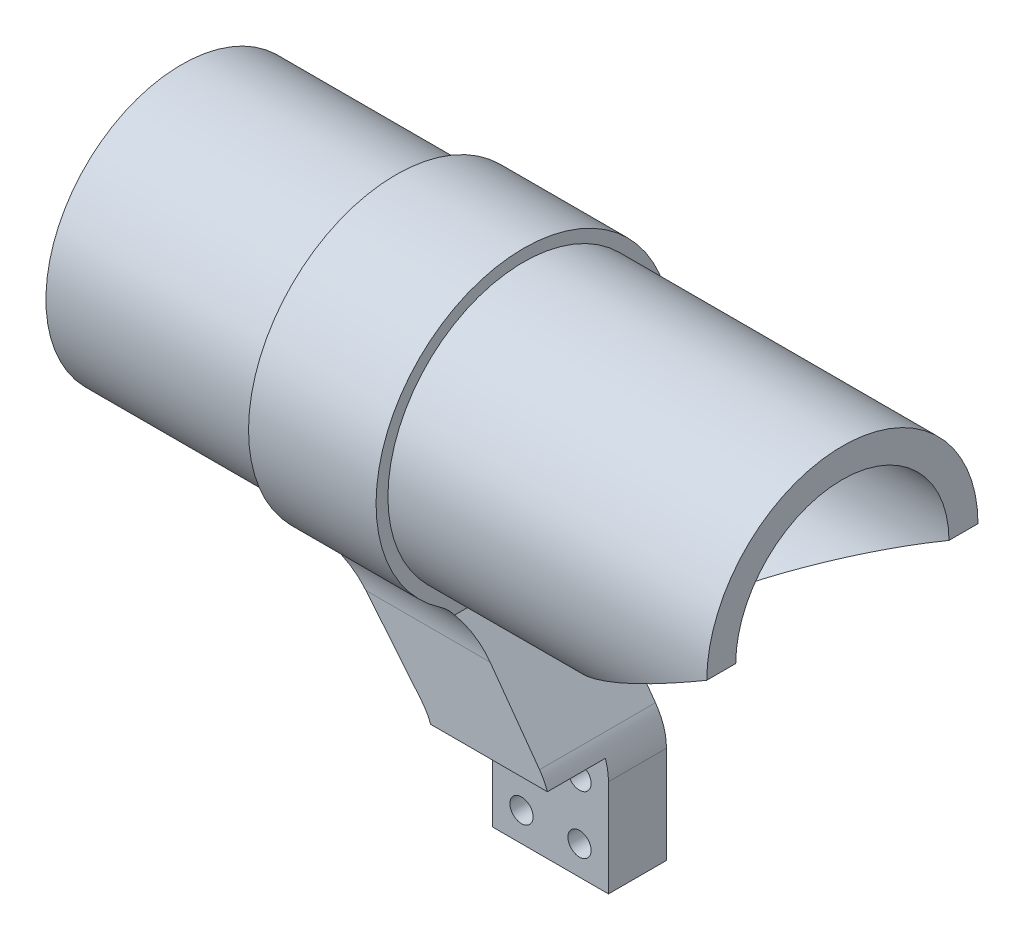
ISO-10303-21;
HEADER;
FILE_DESCRIPTION(('STEP AP214'),'2;1');
FILE_NAME('part.step','',(''),(''),'','','');
FILE_SCHEMA(('AUTOMOTIVE_DESIGN { 1 0 10303 214 1 1 1 1 }'));
ENDSEC;
DATA;
#1=APPLICATION_CONTEXT('core data for automotive mechanical design processes');
#2=APPLICATION_PROTOCOL_DEFINITION('international standard','automotive_design',2000,#1);
#3=PRODUCT_CONTEXT('',#1,'mechanical');
#4=PRODUCT('Part','Part','',(#3));
#5=PRODUCT_RELATED_PRODUCT_CATEGORY('part','',(#4));
#6=PRODUCT_DEFINITION_FORMATION('','',#4);
#7=PRODUCT_DEFINITION_CONTEXT('part definition',#1,'design');
#8=PRODUCT_DEFINITION('design','',#6,#7);
#9=PRODUCT_DEFINITION_SHAPE('','',#8);
#10=(LENGTH_UNIT() NAMED_UNIT(*) SI_UNIT(.MILLI.,.METRE.));
#11=(NAMED_UNIT(*) PLANE_ANGLE_UNIT() SI_UNIT($,.RADIAN.));
#12=(NAMED_UNIT(*) SI_UNIT($,.STERADIAN.) SOLID_ANGLE_UNIT());
#13=UNCERTAINTY_MEASURE_WITH_UNIT(LENGTH_MEASURE(1.E-05),#10,'distance_accuracy_value','');
#14=(GEOMETRIC_REPRESENTATION_CONTEXT(3) GLOBAL_UNCERTAINTY_ASSIGNED_CONTEXT((#13)) GLOBAL_UNIT_ASSIGNED_CONTEXT((#10,
#11,#12)) REPRESENTATION_CONTEXT('',''));
#15=CARTESIAN_POINT('',(0.,0.,0.));
#16=DIRECTION('',(0.,0.,1.));
#17=DIRECTION('',(1.,0.,0.));
#18=AXIS2_PLACEMENT_3D('',#15,#16,#17);
#19=CARTESIAN_POINT('',(114.,0.,0.));
#20=DIRECTION('',(-1.,0.,0.));
#21=DIRECTION('',(0.,0.,1.));
#22=AXIS2_PLACEMENT_3D('',#19,#20,#21);
#23=CYLINDRICAL_SURFACE('',#22,23.4);
#24=CARTESIAN_POINT('',(0.,0.,0.));
#25=DIRECTION('',(1.,0.,0.));
#26=DIRECTION('',(0.,0.,-1.));
#27=AXIS2_PLACEMENT_3D('',#24,#25,#26);
#28=CIRCLE('',#27,23.4);
#29=CARTESIAN_POINT('',(0.,0.,-23.4));
#30=VERTEX_POINT('',#29);
#31=EDGE_CURVE('E266',#30,#30,#28,.T.);
#32=ORIENTED_EDGE('',*,*,#31,.T.);
#33=EDGE_LOOP('',(#32));
#34=FACE_BOUND('',#33,.T.);
#35=CARTESIAN_POINT('',(37.,0.,0.));
#36=DIRECTION('',(1.,0.,0.));
#37=DIRECTION('',(0.,0.,-1.));
#38=AXIS2_PLACEMENT_3D('',#35,#36,#37);
#39=CIRCLE('',#38,23.4);
#40=CARTESIAN_POINT('',(37.,-23.4,0.));
#41=VERTEX_POINT('',#40);
#42=EDGE_CURVE('E276',#41,#41,#39,.T.);
#43=ORIENTED_EDGE('',*,*,#42,.F.);
#44=EDGE_LOOP('',(#43));
#45=FACE_BOUND('',#44,.T.);
#46=ADVANCED_FACE('F39',(#34,#45),#23,.T.);
#47=CARTESIAN_POINT('',(5.,0.,0.));
#48=DIRECTION('',(-1.,0.,0.));
#49=DIRECTION('',(0.,0.,1.));
#50=AXIS2_PLACEMENT_3D('',#47,#48,#49);
#51=CYLINDRICAL_SURFACE('',#50,7.5);
#52=CARTESIAN_POINT('',(0.,0.,0.));
#53=DIRECTION('',(-1.,0.,0.));
#54=DIRECTION('',(0.,0.,1.));
#55=AXIS2_PLACEMENT_3D('',#52,#53,#54);
#56=CIRCLE('',#55,7.5);
#57=CARTESIAN_POINT('',(0.,0.,7.5));
#58=VERTEX_POINT('',#57);
#59=EDGE_CURVE('E257',#58,#58,#56,.T.);
#60=ORIENTED_EDGE('',*,*,#59,.T.);
#61=EDGE_LOOP('',(#60));
#62=FACE_BOUND('',#61,.T.);
#63=CARTESIAN_POINT('',(2.5,0.,0.));
#64=DIRECTION('',(1.,0.,0.));
#65=DIRECTION('',(0.,0.,-1.));
#66=AXIS2_PLACEMENT_3D('',#63,#64,#65);
#67=CIRCLE('',#66,7.5);
#68=CARTESIAN_POINT('',(2.5,0.,-7.5));
#69=VERTEX_POINT('',#68);
#70=EDGE_CURVE('E226',#69,#69,#67,.F.);
#71=ORIENTED_EDGE('',*,*,#70,.F.);
#72=EDGE_LOOP('',(#71));
#73=FACE_BOUND('',#72,.T.);
#74=ADVANCED_FACE('F371',(#62,#73),#51,.F.);
#75=CARTESIAN_POINT('',(0.,0.,0.));
#76=DIRECTION('',(1.,0.,0.));
#77=DIRECTION('',(0.,0.,-1.));
#78=AXIS2_PLACEMENT_3D('',#75,#76,#77);
#79=PLANE('',#78);
#80=ORIENTED_EDGE('',*,*,#31,.F.);
#81=EDGE_LOOP('',(#80));
#82=FACE_BOUND('',#81,.T.);
#83=ORIENTED_EDGE('',*,*,#59,.F.);
#84=EDGE_LOOP('',(#83));
#85=FACE_BOUND('',#84,.T.);
#86=CARTESIAN_POINT('',(0.,-8.48186500766342,-11.1381311714208));
#87=DIRECTION('',(-1.,0.,0.));
#88=DIRECTION('',(0.,0.,1.));
#89=AXIS2_PLACEMENT_3D('',#86,#87,#88);
#90=CIRCLE('',#89,1.24999999999999);
#91=CARTESIAN_POINT('',(0.,-8.48186500766342,-9.88813117142085));
#92=VERTEX_POINT('',#91);
#93=EDGE_CURVE('E251',#92,#92,#90,.T.);
#94=ORIENTED_EDGE('',*,*,#93,.F.);
#95=EDGE_LOOP('',(#94));
#96=FACE_BOUND('',#95,.T.);
#97=CARTESIAN_POINT('',(0.,-11.1381311714208,8.48186500766334));
#98=DIRECTION('',(-1.,0.,0.));
#99=DIRECTION('',(0.,0.,1.));
#100=AXIS2_PLACEMENT_3D('',#97,#98,#99);
#101=CIRCLE('',#100,1.24999999999999);
#102=CARTESIAN_POINT('',(0.,-11.1381311714208,9.73186500766333));
#103=VERTEX_POINT('',#102);
#104=EDGE_CURVE('E245',#103,#103,#101,.T.);
#105=ORIENTED_EDGE('',*,*,#104,.F.);
#106=EDGE_LOOP('',(#105));
#107=FACE_BOUND('',#106,.T.);
#108=CARTESIAN_POINT('',(0.,8.48186500766336,11.1381311714207));
#109=DIRECTION('',(-1.,0.,0.));
#110=DIRECTION('',(0.,0.,1.));
#111=AXIS2_PLACEMENT_3D('',#108,#109,#110);
#112=CIRCLE('',#111,1.24999999999999);
#113=CARTESIAN_POINT('',(0.,8.48186500766336,12.3881311714207));
#114=VERTEX_POINT('',#113);
#115=EDGE_CURVE('E239',#114,#114,#112,.T.);
#116=ORIENTED_EDGE('',*,*,#115,.F.);
#117=EDGE_LOOP('',(#116));
#118=FACE_BOUND('',#117,.T.);
#119=CARTESIAN_POINT('',(0.,11.1381311714207,-8.48186500766345));
#120=DIRECTION('',(-1.,0.,0.));
#121=DIRECTION('',(0.,0.,1.));
#122=AXIS2_PLACEMENT_3D('',#119,#120,#121);
#123=CIRCLE('',#122,1.24999999999999);
#124=CARTESIAN_POINT('',(0.,11.1381311714207,-7.23186500766346));
#125=VERTEX_POINT('',#124);
#126=EDGE_CURVE('E235',#125,#125,#123,.T.);
#127=ORIENTED_EDGE('',*,*,#126,.F.);
#128=EDGE_LOOP('',(#127));
#129=FACE_BOUND('',#128,.T.);
#130=ADVANCED_FACE('F380',(#82,#85,#96,#107,#118,#129),#79,.F.);
#131=CARTESIAN_POINT('',(5.,0.,0.));
#132=DIRECTION('',(-1.,0.,0.));
#133=DIRECTION('',(0.,0.,1.));
#134=AXIS2_PLACEMENT_3D('',#131,#132,#133);
#135=PLANE('',#134);
#136=CARTESIAN_POINT('',(5.,0.,0.));
#137=DIRECTION('',(1.,0.,0.));
#138=DIRECTION('',(0.,0.,-1.));
#139=AXIS2_PLACEMENT_3D('',#136,#137,#138);
#140=CIRCLE('',#139,11.4999999999999);
#141=CARTESIAN_POINT('',(5.,0.,-11.4999999999999));
#142=VERTEX_POINT('',#141);
#143=EDGE_CURVE('E218',#142,#142,#140,.T.);
#144=ORIENTED_EDGE('',*,*,#143,.F.);
#145=EDGE_LOOP('',(#144));
#146=FACE_BOUND('',#145,.T.);
#147=CARTESIAN_POINT('',(5.,-8.48186500766342,-11.1381311714208));
#148=DIRECTION('',(-1.,0.,0.));
#149=DIRECTION('',(0.,0.,1.));
#150=AXIS2_PLACEMENT_3D('',#147,#148,#149);
#151=CIRCLE('',#150,1.24999999999999);
#152=CARTESIAN_POINT('',(5.,-8.48186500766342,-9.88813117142085));
#153=VERTEX_POINT('',#152);
#154=EDGE_CURVE('E254',#153,#153,#151,.T.);
#155=ORIENTED_EDGE('',*,*,#154,.T.);
#156=EDGE_LOOP('',(#155));
#157=FACE_BOUND('',#156,.T.);
#158=CARTESIAN_POINT('',(5.,-11.1381311714208,8.48186500766334));
#159=DIRECTION('',(-1.,0.,0.));
#160=DIRECTION('',(0.,0.,1.));
#161=AXIS2_PLACEMENT_3D('',#158,#159,#160);
#162=CIRCLE('',#161,1.24999999999999);
#163=CARTESIAN_POINT('',(5.,-11.1381311714208,9.73186500766333));
#164=VERTEX_POINT('',#163);
#165=EDGE_CURVE('E248',#164,#164,#162,.T.);
#166=ORIENTED_EDGE('',*,*,#165,.T.);
#167=EDGE_LOOP('',(#166));
#168=FACE_BOUND('',#167,.T.);
#169=CARTESIAN_POINT('',(5.,8.48186500766336,11.1381311714207));
#170=DIRECTION('',(-1.,0.,0.));
#171=DIRECTION('',(0.,0.,1.));
#172=AXIS2_PLACEMENT_3D('',#169,#170,#171);
#173=CIRCLE('',#172,1.24999999999999);
#174=CARTESIAN_POINT('',(5.,8.48186500766336,12.3881311714207));
#175=VERTEX_POINT('',#174);
#176=EDGE_CURVE('E242',#175,#175,#173,.T.);
#177=ORIENTED_EDGE('',*,*,#176,.T.);
#178=EDGE_LOOP('',(#177));
#179=FACE_BOUND('',#178,.T.);
#180=CARTESIAN_POINT('',(5.,11.1381311714207,-8.48186500766345));
#181=DIRECTION('',(-1.,0.,0.));
#182=DIRECTION('',(0.,0.,1.));
#183=AXIS2_PLACEMENT_3D('',#180,#181,#182);
#184=CIRCLE('',#183,1.24999999999999);
#185=CARTESIAN_POINT('',(5.,11.1381311714207,-7.23186500766346));
#186=VERTEX_POINT('',#185);
#187=EDGE_CURVE('E236',#186,#186,#184,.T.);
#188=ORIENTED_EDGE('',*,*,#187,.T.);
#189=EDGE_LOOP('',(#188));
#190=FACE_BOUND('',#189,.T.);
#191=CARTESIAN_POINT('',(5.,0.,0.));
#192=DIRECTION('',(-1.,0.,0.));
#193=DIRECTION('',(0.,0.,1.));
#194=AXIS2_PLACEMENT_3D('',#191,#192,#193);
#195=CIRCLE('',#194,18.4);
#196=CARTESIAN_POINT('',(5.,0.,18.4));
#197=VERTEX_POINT('',#196);
#198=EDGE_CURVE('E262',#197,#197,#195,.T.);
#199=ORIENTED_EDGE('',*,*,#198,.F.);
#200=EDGE_LOOP('',(#199));
#201=FACE_BOUND('',#200,.T.);
#202=ADVANCED_FACE('F409',(#146,#157,#168,#179,#190,#201),#135,.F.);
#203=CARTESIAN_POINT('',(5.,-8.48186500766342,-11.1381311714208));
#204=DIRECTION('',(-1.,0.,0.));
#205=DIRECTION('',(0.,0.,1.));
#206=AXIS2_PLACEMENT_3D('',#203,#204,#205);
#207=CYLINDRICAL_SURFACE('',#206,1.24999999999999);
#208=ORIENTED_EDGE('',*,*,#154,.F.);
#209=EDGE_LOOP('',(#208));
#210=FACE_BOUND('',#209,.T.);
#211=ORIENTED_EDGE('',*,*,#93,.T.);
#212=EDGE_LOOP('',(#211));
#213=FACE_BOUND('',#212,.T.);
#214=ADVANCED_FACE('F411',(#210,#213),#207,.F.);
#215=CARTESIAN_POINT('',(5.,-11.1381311714208,8.48186500766334));
#216=DIRECTION('',(-1.,0.,0.));
#217=DIRECTION('',(0.,0.,1.));
#218=AXIS2_PLACEMENT_3D('',#215,#216,#217);
#219=CYLINDRICAL_SURFACE('',#218,1.24999999999999);
#220=ORIENTED_EDGE('',*,*,#165,.F.);
#221=EDGE_LOOP('',(#220));
#222=FACE_BOUND('',#221,.T.);
#223=ORIENTED_EDGE('',*,*,#104,.T.);
#224=EDGE_LOOP('',(#223));
#225=FACE_BOUND('',#224,.T.);
#226=ADVANCED_FACE('F418',(#222,#225),#219,.F.);
#227=CARTESIAN_POINT('',(5.,8.48186500766336,11.1381311714207));
#228=DIRECTION('',(-1.,0.,0.));
#229=DIRECTION('',(0.,0.,1.));
#230=AXIS2_PLACEMENT_3D('',#227,#228,#229);
#231=CYLINDRICAL_SURFACE('',#230,1.24999999999999);
#232=ORIENTED_EDGE('',*,*,#176,.F.);
#233=EDGE_LOOP('',(#232));
#234=FACE_BOUND('',#233,.T.);
#235=ORIENTED_EDGE('',*,*,#115,.T.);
#236=EDGE_LOOP('',(#235));
#237=FACE_BOUND('',#236,.T.);
#238=ADVANCED_FACE('F446',(#234,#237),#231,.F.);
#239=CARTESIAN_POINT('',(5.,11.1381311714207,-8.48186500766345));
#240=DIRECTION('',(-1.,0.,0.));
#241=DIRECTION('',(0.,0.,1.));
#242=AXIS2_PLACEMENT_3D('',#239,#240,#241);
#243=CYLINDRICAL_SURFACE('',#242,1.24999999999999);
#244=ORIENTED_EDGE('',*,*,#187,.F.);
#245=EDGE_LOOP('',(#244));
#246=FACE_BOUND('',#245,.T.);
#247=ORIENTED_EDGE('',*,*,#126,.T.);
#248=EDGE_LOOP('',(#247));
#249=FACE_BOUND('',#248,.T.);
#250=ADVANCED_FACE('F441',(#246,#249),#243,.F.);
#251=CARTESIAN_POINT('',(2.5,0.,0.));
#252=DIRECTION('',(1.,0.,0.));
#253=DIRECTION('',(0.,0.,-1.));
#254=AXIS2_PLACEMENT_3D('',#251,#252,#253);
#255=PLANE('',#254);
#256=CARTESIAN_POINT('',(2.5,0.,0.));
#257=DIRECTION('',(1.,0.,0.));
#258=DIRECTION('',(0.,0.,-1.));
#259=AXIS2_PLACEMENT_3D('',#256,#257,#258);
#260=CIRCLE('',#259,11.4999999999999);
#261=CARTESIAN_POINT('',(2.5,0.,-11.4999999999999));
#262=VERTEX_POINT('',#261);
#263=EDGE_CURVE('E223',#262,#262,#260,.T.);
#264=ORIENTED_EDGE('',*,*,#263,.T.);
#265=EDGE_LOOP('',(#264));
#266=FACE_BOUND('',#265,.T.);
#267=ORIENTED_EDGE('',*,*,#70,.T.);
#268=EDGE_LOOP('',(#267));
#269=FACE_BOUND('',#268,.T.);
#270=ADVANCED_FACE('F438',(#266,#269),#255,.T.);
#271=CARTESIAN_POINT('',(2.5,0.,0.));
#272=DIRECTION('',(1.,0.,0.));
#273=DIRECTION('',(0.,0.,-1.));
#274=AXIS2_PLACEMENT_3D('',#271,#272,#273);
#275=CYLINDRICAL_SURFACE('',#274,11.4999999999999);
#276=ORIENTED_EDGE('',*,*,#263,.F.);
#277=EDGE_LOOP('',(#276));
#278=FACE_BOUND('',#277,.T.);
#279=ORIENTED_EDGE('',*,*,#143,.T.);
#280=EDGE_LOOP('',(#279));
#281=FACE_BOUND('',#280,.T.);
#282=ADVANCED_FACE('F440',(#278,#281),#275,.F.);
#283=CARTESIAN_POINT('',(37.,0.,0.));
#284=DIRECTION('',(1.,0.,0.));
#285=DIRECTION('',(0.,0.,-1.));
#286=AXIS2_PLACEMENT_3D('',#283,#284,#285);
#287=PLANE('',#286);
#288=DIRECTION('',(0.,0.,-1.));
#289=VECTOR('',#288,1.);
#290=CARTESIAN_POINT('',(37.,-23.4,10.));
#291=LINE('',#290,#289);
#292=CARTESIAN_POINT('',(37.,-23.4,-11.9012968975138));
#293=VERTEX_POINT('',#292);
#294=EDGE_CURVE('E221',#41,#293,#291,.T.);
#295=ORIENTED_EDGE('',*,*,#294,.F.);
#296=ORIENTED_EDGE('',*,*,#42,.T.);
#297=CARTESIAN_POINT('',(37.,-23.4,11.9012968975138));
#298=VERTEX_POINT('',#297);
#299=EDGE_CURVE('E61',#298,#41,#291,.T.);
#300=ORIENTED_EDGE('',*,*,#299,.F.);
#301=CARTESIAN_POINT('',(37.,-29.2660896735201,20.));
#302=DIRECTION('',(1.,0.,0.));
#303=DIRECTION('',(0.,0.,-1.));
#304=AXIS2_PLACEMENT_3D('',#301,#302,#303);
#305=CIRCLE('',#304,10.);
#306=CARTESIAN_POINT('',(37.,-21.009841090767,14.3578054500233));
#307=VERTEX_POINT('',#306);
#308=EDGE_CURVE('E305',#298,#307,#305,.T.);
#309=ORIENTED_EDGE('',*,*,#308,.T.);
#310=CARTESIAN_POINT('',(37.,0.,0.));
#311=DIRECTION('',(1.,0.,0.));
#312=DIRECTION('',(0.,0.,-1.));
#313=AXIS2_PLACEMENT_3D('',#310,#311,#312);
#314=CIRCLE('',#313,25.4472002389261);
#315=CARTESIAN_POINT('',(37.,-21.009841090767,-14.3578054500233));
#316=VERTEX_POINT('',#315);
#317=EDGE_CURVE('E212',#316,#307,#314,.T.);
#318=ORIENTED_EDGE('',*,*,#317,.F.);
#319=CARTESIAN_POINT('',(37.,-29.2660896735201,-20.));
#320=DIRECTION('',(1.,0.,0.));
#321=DIRECTION('',(0.,0.,-1.));
#322=AXIS2_PLACEMENT_3D('',#319,#320,#321);
#323=CIRCLE('',#322,10.);
#324=EDGE_CURVE('E293',#316,#293,#323,.T.);
#325=ORIENTED_EDGE('',*,*,#324,.T.);
#326=EDGE_LOOP('',(#295,#296,#300,#309,#318,#325));
#327=FACE_BOUND('',#326,.T.);
#328=ADVANCED_FACE('F361',(#327),#287,.F.);
#329=CARTESIAN_POINT('',(59.,0.,0.));
#330=DIRECTION('',(1.,0.,0.));
#331=DIRECTION('',(0.,0.,-1.));
#332=AXIS2_PLACEMENT_3D('',#329,#330,#331);
#333=PLANE('',#332);
#334=DIRECTION('',(0.,0.,-1.));
#335=VECTOR('',#334,1.);
#336=CARTESIAN_POINT('',(59.,-23.4,10.));
#337=LINE('',#336,#335);
#338=CARTESIAN_POINT('',(59.,-23.4,11.9012968975138));
#339=VERTEX_POINT('',#338);
#340=CARTESIAN_POINT('',(59.,-23.4,0.));
#341=VERTEX_POINT('',#340);
#342=EDGE_CURVE('E53',#339,#341,#337,.T.);
#343=ORIENTED_EDGE('',*,*,#342,.T.);
#344=CARTESIAN_POINT('',(59.,0.,0.));
#345=DIRECTION('',(1.,0.,0.));
#346=DIRECTION('',(0.,0.,-1.));
#347=AXIS2_PLACEMENT_3D('',#344,#345,#346);
#348=CIRCLE('',#347,23.4);
#349=EDGE_CURVE('E280',#341,#341,#348,.T.);
#350=ORIENTED_EDGE('',*,*,#349,.F.);
#351=CARTESIAN_POINT('',(59.,-23.4,-11.9012968975138));
#352=VERTEX_POINT('',#351);
#353=EDGE_CURVE('E216',#341,#352,#337,.T.);
#354=ORIENTED_EDGE('',*,*,#353,.T.);
#355=CARTESIAN_POINT('',(59.,-29.2660896735201,-20.));
#356=DIRECTION('',(1.,0.,0.));
#357=DIRECTION('',(0.,0.,-1.));
#358=AXIS2_PLACEMENT_3D('',#355,#356,#357);
#359=CIRCLE('',#358,10.);
#360=CARTESIAN_POINT('',(59.,-21.009841090767,-14.3578054500233));
#361=VERTEX_POINT('',#360);
#362=EDGE_CURVE('E301',#352,#361,#359,.F.);
#363=ORIENTED_EDGE('',*,*,#362,.T.);
#364=CARTESIAN_POINT('',(59.,0.,0.));
#365=DIRECTION('',(1.,0.,0.));
#366=DIRECTION('',(0.,0.,-1.));
#367=AXIS2_PLACEMENT_3D('',#364,#365,#366);
#368=CIRCLE('',#367,25.4472002389261);
#369=CARTESIAN_POINT('',(59.,-21.009841090767,14.3578054500233));
#370=VERTEX_POINT('',#369);
#371=EDGE_CURVE('E213',#361,#370,#368,.T.);
#372=ORIENTED_EDGE('',*,*,#371,.T.);
#373=CARTESIAN_POINT('',(59.,-29.2660896735201,20.));
#374=DIRECTION('',(1.,0.,0.));
#375=DIRECTION('',(0.,0.,-1.));
#376=AXIS2_PLACEMENT_3D('',#373,#374,#375);
#377=CIRCLE('',#376,10.);
#378=EDGE_CURVE('E47',#370,#339,#377,.F.);
#379=ORIENTED_EDGE('',*,*,#378,.T.);
#380=EDGE_LOOP('',(#343,#350,#354,#363,#372,#379));
#381=FACE_BOUND('',#380,.T.);
#382=ADVANCED_FACE('F309',(#381),#333,.T.);
#383=CARTESIAN_POINT('',(59.,0.,0.));
#384=DIRECTION('',(-1.,0.,0.));
#385=DIRECTION('',(0.,0.,1.));
#386=AXIS2_PLACEMENT_3D('',#383,#384,#385);
#387=CYLINDRICAL_SURFACE('',#386,25.4472002389261);
#388=ORIENTED_EDGE('',*,*,#371,.F.);
#389=DIRECTION('',(-1.,0.,0.));
#390=VECTOR('',#389,1.);
#391=CARTESIAN_POINT('',(59.,-21.009841090767,-14.3578054500233));
#392=LINE('',#391,#390);
#393=EDGE_CURVE('E285',#361,#316,#392,.T.);
#394=ORIENTED_EDGE('',*,*,#393,.T.);
#395=ORIENTED_EDGE('',*,*,#317,.T.);
#396=DIRECTION('',(-1.,0.,0.));
#397=VECTOR('',#396,1.);
#398=CARTESIAN_POINT('',(59.,-21.009841090767,14.3578054500233));
#399=LINE('',#398,#397);
#400=EDGE_CURVE('E283',#307,#370,#399,.F.);
#401=ORIENTED_EDGE('',*,*,#400,.T.);
#402=EDGE_LOOP('',(#388,#394,#395,#401));
#403=FACE_BOUND('',#402,.T.);
#404=ADVANCED_FACE('F363',(#403),#387,.T.);
#405=CARTESIAN_POINT('',(114.,0.,0.));
#406=DIRECTION('',(1.,0.,0.));
#407=DIRECTION('',(0.,0.,-1.));
#408=AXIS2_PLACEMENT_3D('',#405,#406,#407);
#409=PLANE('',#408);
#410=DIRECTION('',(0.,0.,1.));
#411=VECTOR('',#410,1.);
#412=CARTESIAN_POINT('',(114.,0.0999999999999994,-23.5));
#413=LINE('',#412,#411);
#414=CARTESIAN_POINT('',(114.,0.0999999999999994,-23.3997863238107));
#415=VERTEX_POINT('',#414);
#416=CARTESIAN_POINT('',(114.,0.0999999999999994,-18.399728258863));
#417=VERTEX_POINT('',#416);
#418=EDGE_CURVE('E232',#415,#417,#413,.T.);
#419=ORIENTED_EDGE('',*,*,#418,.F.);
#420=CARTESIAN_POINT('',(114.,0.,0.));
#421=DIRECTION('',(1.,0.,0.));
#422=DIRECTION('',(0.,0.,-1.));
#423=AXIS2_PLACEMENT_3D('',#420,#421,#422);
#424=CIRCLE('',#423,23.4);
#425=CARTESIAN_POINT('',(114.,0.0999999999999994,23.3997863238107));
#426=VERTEX_POINT('',#425);
#427=EDGE_CURVE('E267',#415,#426,#424,.T.);
#428=ORIENTED_EDGE('',*,*,#427,.T.);
#429=CARTESIAN_POINT('',(114.,0.0999999999999994,18.399728258863));
#430=VERTEX_POINT('',#429);
#431=EDGE_CURVE('E229',#430,#426,#413,.T.);
#432=ORIENTED_EDGE('',*,*,#431,.F.);
#433=CARTESIAN_POINT('',(114.,0.,0.));
#434=DIRECTION('',(1.,0.,0.));
#435=DIRECTION('',(0.,0.,-1.));
#436=AXIS2_PLACEMENT_3D('',#433,#434,#435);
#437=CIRCLE('',#436,18.4);
#438=EDGE_CURVE('E263',#417,#430,#437,.T.);
#439=ORIENTED_EDGE('',*,*,#438,.F.);
#440=EDGE_LOOP('',(#419,#428,#432,#439));
#441=FACE_BOUND('',#440,.T.);
#442=ADVANCED_FACE('F402',(#441),#409,.T.);
#443=CARTESIAN_POINT('',(114.,0.,0.));
#444=DIRECTION('',(-1.,0.,0.));
#445=DIRECTION('',(0.,0.,1.));
#446=AXIS2_PLACEMENT_3D('',#443,#444,#445);
#447=CYLINDRICAL_SURFACE('',#446,18.4);
#448=CARTESIAN_POINT('',(113.829787234043,0.,0.));
#449=DIRECTION('',(-0.506549048630866,0.862211146605728,0.));
#450=DIRECTION('',(-0.862211146605728,-0.506549048630866,0.));
#451=AXIS2_PLACEMENT_3D('',#448,#449,#450);
#452=ELLIPSE('',#451,36.3242218097788,18.4);
#453=EDGE_CURVE('E233',#417,#430,#452,.T.);
#454=ORIENTED_EDGE('',*,*,#453,.F.);
#455=ORIENTED_EDGE('',*,*,#438,.T.);
#456=EDGE_LOOP('',(#454,#455));
#457=FACE_BOUND('',#456,.T.);
#458=ORIENTED_EDGE('',*,*,#198,.T.);
#459=EDGE_LOOP('',(#458));
#460=FACE_BOUND('',#459,.T.);
#461=ADVANCED_FACE('F392',(#457,#460),#447,.F.);
#462=CARTESIAN_POINT('',(114.,0.0999999999999994,-23.5));
#463=DIRECTION('',(-0.506549048630866,0.862211146605728,0.));
#464=DIRECTION('',(-0.862211146605728,-0.506549048630866,0.));
#465=AXIS2_PLACEMENT_3D('',#462,#463,#464);
#466=PLANE('',#465);
#467=ORIENTED_EDGE('',*,*,#453,.T.);
#468=ORIENTED_EDGE('',*,*,#431,.T.);
#469=CARTESIAN_POINT('',(113.829787234043,0.,0.));
#470=DIRECTION('',(-0.506549048630866,0.862211146605728,0.));
#471=DIRECTION('',(-0.862211146605728,-0.506549048630866,0.));
#472=AXIS2_PLACEMENT_3D('',#469,#470,#471);
#473=ELLIPSE('',#472,46.1949342580883,23.4);
#474=EDGE_CURVE('E270',#415,#426,#473,.T.);
#475=ORIENTED_EDGE('',*,*,#474,.F.);
#476=ORIENTED_EDGE('',*,*,#418,.T.);
#477=EDGE_LOOP('',(#467,#468,#475,#476));
#478=FACE_BOUND('',#477,.T.);
#479=ADVANCED_FACE('F384',(#478),#466,.F.);
#480=ORIENTED_EDGE('',*,*,#349,.T.);
#481=EDGE_LOOP('',(#480));
#482=FACE_BOUND('',#481,.T.);
#483=ORIENTED_EDGE('',*,*,#474,.T.);
#484=ORIENTED_EDGE('',*,*,#427,.F.);
#485=EDGE_LOOP('',(#483,#484));
#486=FACE_BOUND('',#485,.T.);
#487=ADVANCED_FACE('F374',(#482,#486),#23,.T.);
#488=CARTESIAN_POINT('',(0.,0.,10.));
#489=DIRECTION('',(0.,0.,-1.));
#490=DIRECTION('',(-1.,0.,0.));
#491=AXIS2_PLACEMENT_3D('',#488,#489,#490);
#492=PLANE('',#491);
#493=DIRECTION('',(-0.585327901781094,0.810796674510042,0.));
#494=VECTOR('',#493,1.);
#495=CARTESIAN_POINT('',(73.6501592134182,-43.6934121799724,10.));
#496=LINE('',#495,#494);
#497=CARTESIAN_POINT('',(71.7581259585187,-41.0725662123242,10.));
#498=VERTEX_POINT('',#497);
#499=CARTESIAN_POINT('',(63.2348298509441,-29.2660896735201,10.));
#500=VERTEX_POINT('',#499);
#501=EDGE_CURVE('E318',#498,#500,#496,.T.);
#502=ORIENTED_EDGE('',*,*,#501,.T.);
#503=DIRECTION('',(1.,0.,0.));
#504=VECTOR('',#503,1.);
#505=CARTESIAN_POINT('',(37.,-29.2660896735201,10.));
#506=LINE('',#505,#504);
#507=CARTESIAN_POINT('',(41.8129573360113,-29.2660896735201,10.));
#508=VERTEX_POINT('',#507);
#509=EDGE_CURVE('E290',#500,#508,#506,.F.);
#510=ORIENTED_EDGE('',*,*,#509,.T.);
#511=DIRECTION('',(0.634297358068504,-0.773089167914876,0.));
#512=VECTOR('',#511,1.);
#513=CARTESIAN_POINT('',(37.,-23.4,10.));
#514=LINE('',#513,#512);
#515=CARTESIAN_POINT('',(51.381050892567,-40.9277959569798,10.));
#516=VERTEX_POINT('',#515);
#517=EDGE_CURVE('E188',#508,#516,#514,.T.);
#518=ORIENTED_EDGE('',*,*,#517,.T.);
#519=CARTESIAN_POINT('',(43.6501592134182,-47.2707695376648,10.));
#520=DIRECTION('',(0.,0.,-1.));
#521=DIRECTION('',(-1.,0.,0.));
#522=AXIS2_PLACEMENT_3D('',#519,#520,#521);
#523=CIRCLE('',#522,10.);
#524=CARTESIAN_POINT('',(52.988387864258,-43.6934121799724,10.));
#525=VERTEX_POINT('',#524);
#526=EDGE_CURVE('E205',#516,#525,#523,.T.);
#527=ORIENTED_EDGE('',*,*,#526,.T.);
#528=DIRECTION('',(-1.,0.,0.));
#529=VECTOR('',#528,1.);
#530=CARTESIAN_POINT('',(73.6501592134182,-43.6934121799724,10.));
#531=LINE('',#530,#529);
#532=CARTESIAN_POINT('',(73.113318124491,-43.6934121799724,10.));
#533=VERTEX_POINT('',#532);
#534=EDGE_CURVE('E167',#533,#525,#531,.T.);
#535=ORIENTED_EDGE('',*,*,#534,.F.);
#536=CARTESIAN_POINT('',(63.6501592134183,-46.9258452301351,10.));
#537=DIRECTION('',(0.,0.,-1.));
#538=DIRECTION('',(-1.,0.,0.));
#539=AXIS2_PLACEMENT_3D('',#536,#537,#538);
#540=CIRCLE('',#539,10.);
#541=EDGE_CURVE('E200',#533,#498,#540,.F.);
#542=ORIENTED_EDGE('',*,*,#541,.T.);
#543=EDGE_LOOP('',(#502,#510,#518,#527,#535,#542));
#544=FACE_BOUND('',#543,.T.);
#545=ADVANCED_FACE('F321',(#544),#492,.F.);
#546=CARTESIAN_POINT('',(0.,0.,-10.));
#547=DIRECTION('',(0.,0.,-1.));
#548=DIRECTION('',(-1.,0.,0.));
#549=AXIS2_PLACEMENT_3D('',#546,#547,#548);
#550=PLANE('',#549);
#551=CARTESIAN_POINT('',(68.6501592134182,-58.6934121799724,-10.));
#552=DIRECTION('',(0.,0.,1.));
#553=DIRECTION('',(1.,0.,0.));
#554=AXIS2_PLACEMENT_3D('',#551,#552,#553);
#555=CIRCLE('',#554,2.);
#556=CARTESIAN_POINT('',(70.6501592134182,-58.6934121799724,-10.));
#557=VERTEX_POINT('',#556);
#558=EDGE_CURVE('E740',#557,#557,#555,.T.);
#559=ORIENTED_EDGE('',*,*,#558,.T.);
#560=EDGE_LOOP('',(#559));
#561=FACE_BOUND('',#560,.T.);
#562=CARTESIAN_POINT('',(58.6501592134182,-48.6934121799724,-10.));
#563=DIRECTION('',(0.,0.,1.));
#564=DIRECTION('',(1.,0.,0.));
#565=AXIS2_PLACEMENT_3D('',#562,#563,#564);
#566=CIRCLE('',#565,2.);
#567=CARTESIAN_POINT('',(60.6501592134182,-48.6934121799724,-10.));
#568=VERTEX_POINT('',#567);
#569=EDGE_CURVE('E331',#568,#568,#566,.T.);
#570=ORIENTED_EDGE('',*,*,#569,.T.);
#571=EDGE_LOOP('',(#570));
#572=FACE_BOUND('',#571,.T.);
#573=DIRECTION('',(0.634297358068504,-0.773089167914876,0.));
#574=VECTOR('',#573,1.);
#575=CARTESIAN_POINT('',(37.,-23.4,-10.));
#576=LINE('',#575,#574);
#577=CARTESIAN_POINT('',(41.8129573360113,-29.2660896735201,-10.));
#578=VERTEX_POINT('',#577);
#579=CARTESIAN_POINT('',(51.381050892567,-40.9277959569798,-10.));
#580=VERTEX_POINT('',#579);
#581=EDGE_CURVE('E329',#578,#580,#576,.T.);
#582=ORIENTED_EDGE('',*,*,#581,.F.);
#583=DIRECTION('',(-1.,0.,0.));
#584=VECTOR('',#583,1.);
#585=CARTESIAN_POINT('',(0.,-29.2660896735201,-10.));
#586=LINE('',#585,#584);
#587=CARTESIAN_POINT('',(63.2348298509441,-29.2660896735201,-10.));
#588=VERTEX_POINT('',#587);
#589=EDGE_CURVE('E288',#578,#588,#586,.F.);
#590=ORIENTED_EDGE('',*,*,#589,.T.);
#591=DIRECTION('',(-0.585327901781094,0.810796674510042,0.));
#592=VECTOR('',#591,1.);
#593=CARTESIAN_POINT('',(73.6501592134182,-43.6934121799724,-10.));
#594=LINE('',#593,#592);
#595=CARTESIAN_POINT('',(71.7581259585187,-41.0725662123242,-10.));
#596=VERTEX_POINT('',#595);
#597=EDGE_CURVE('E337',#596,#588,#594,.T.);
#598=ORIENTED_EDGE('',*,*,#597,.F.);
#599=CARTESIAN_POINT('',(63.6501592134183,-46.9258452301351,-10.));
#600=DIRECTION('',(0.,0.,-1.));
#601=DIRECTION('',(-1.,0.,0.));
#602=AXIS2_PLACEMENT_3D('',#599,#600,#601);
#603=CIRCLE('',#602,10.);
#604=CARTESIAN_POINT('',(73.6501592134182,-46.9258452301351,-10.));
#605=VERTEX_POINT('',#604);
#606=EDGE_CURVE('E197',#596,#605,#603,.T.);
#607=ORIENTED_EDGE('',*,*,#606,.T.);
#608=DIRECTION('',(0.,1.,0.));
#609=VECTOR('',#608,1.);
#610=CARTESIAN_POINT('',(73.6501592134182,-43.6934121799724,-10.));
#611=LINE('',#610,#609);
#612=CARTESIAN_POINT('',(73.6501592134182,-63.6934121799724,-10.));
#613=VERTEX_POINT('',#612);
#614=EDGE_CURVE('E335',#613,#605,#611,.T.);
#615=ORIENTED_EDGE('',*,*,#614,.F.);
#616=DIRECTION('',(1.,0.,0.));
#617=VECTOR('',#616,1.);
#618=CARTESIAN_POINT('',(73.6501592134182,-63.6934121799724,-10.));
#619=LINE('',#618,#617);
#620=CARTESIAN_POINT('',(53.6501592134182,-63.6934121799724,-10.));
#621=VERTEX_POINT('',#620);
#622=EDGE_CURVE('E182',#621,#613,#619,.T.);
#623=ORIENTED_EDGE('',*,*,#622,.F.);
#624=DIRECTION('',(0.,-1.,0.));
#625=VECTOR('',#624,1.);
#626=CARTESIAN_POINT('',(53.6501592134182,-63.6934121799724,-10.));
#627=LINE('',#626,#625);
#628=CARTESIAN_POINT('',(53.6501592134182,-47.2707695376648,-10.));
#629=VERTEX_POINT('',#628);
#630=EDGE_CURVE('E325',#629,#621,#627,.T.);
#631=ORIENTED_EDGE('',*,*,#630,.F.);
#632=CARTESIAN_POINT('',(43.6501592134182,-47.2707695376648,-10.));
#633=DIRECTION('',(0.,0.,-1.));
#634=DIRECTION('',(-1.,0.,0.));
#635=AXIS2_PLACEMENT_3D('',#632,#633,#634);
#636=CIRCLE('',#635,10.);
#637=EDGE_CURVE('E202',#629,#580,#636,.F.);
#638=ORIENTED_EDGE('',*,*,#637,.T.);
#639=EDGE_LOOP('',(#582,#590,#598,#607,#615,#623,#631,#638));
#640=FACE_BOUND('',#639,.T.);
#641=CARTESIAN_POINT('',(58.6501592134182,-58.6934121799724,-10.));
#642=DIRECTION('',(0.,0.,1.));
#643=DIRECTION('',(1.,0.,0.));
#644=AXIS2_PLACEMENT_3D('',#641,#642,#643);
#645=CIRCLE('',#644,2.);
#646=CARTESIAN_POINT('',(60.6501592134182,-58.6934121799724,-10.));
#647=VERTEX_POINT('',#646);
#648=EDGE_CURVE('E742',#647,#647,#645,.T.);
#649=ORIENTED_EDGE('',*,*,#648,.T.);
#650=EDGE_LOOP('',(#649));
#651=FACE_BOUND('',#650,.T.);
#652=CARTESIAN_POINT('',(68.6501592134182,-48.6934121799724,-10.));
#653=DIRECTION('',(0.,0.,1.));
#654=DIRECTION('',(1.,0.,0.));
#655=AXIS2_PLACEMENT_3D('',#652,#653,#654);
#656=CIRCLE('',#655,2.);
#657=CARTESIAN_POINT('',(70.6501592134182,-48.6934121799724,-10.));
#658=VERTEX_POINT('',#657);
#659=EDGE_CURVE('E737',#658,#658,#656,.T.);
#660=ORIENTED_EDGE('',*,*,#659,.T.);
#661=EDGE_LOOP('',(#660));
#662=FACE_BOUND('',#661,.T.);
#663=ADVANCED_FACE('F350',(#561,#572,#640,#651,#662),#550,.T.);
#664=CARTESIAN_POINT('',(73.6501592134182,-63.6934121799724,10.));
#665=DIRECTION('',(0.,1.,0.));
#666=DIRECTION('',(0.,0.,1.));
#667=AXIS2_PLACEMENT_3D('',#664,#665,#666);
#668=PLANE('',#667);
#669=DIRECTION('',(0.,0.,-1.));
#670=VECTOR('',#669,1.);
#671=CARTESIAN_POINT('',(73.6501592134182,-63.6934121799724,10.));
#672=LINE('',#671,#670);
#673=CARTESIAN_POINT('',(73.6501592134182,-63.6934121799724,0.));
#674=VERTEX_POINT('',#673);
#675=EDGE_CURVE('E173',#674,#613,#672,.T.);
#676=ORIENTED_EDGE('',*,*,#675,.F.);
#677=DIRECTION('',(1.,0.,0.));
#678=VECTOR('',#677,1.);
#679=CARTESIAN_POINT('',(50.4957971199191,-63.6934121799724,0.));
#680=LINE('',#679,#678);
#681=CARTESIAN_POINT('',(53.6501592134182,-63.6934121799724,0.));
#682=VERTEX_POINT('',#681);
#683=EDGE_CURVE('E157',#682,#674,#680,.T.);
#684=ORIENTED_EDGE('',*,*,#683,.F.);
#685=DIRECTION('',(0.,0.,-1.));
#686=VECTOR('',#685,1.);
#687=CARTESIAN_POINT('',(53.6501592134182,-63.6934121799724,10.));
#688=LINE('',#687,#686);
#689=EDGE_CURVE('E184',#682,#621,#688,.T.);
#690=ORIENTED_EDGE('',*,*,#689,.T.);
#691=ORIENTED_EDGE('',*,*,#622,.T.);
#692=EDGE_LOOP('',(#676,#684,#690,#691));
#693=FACE_BOUND('',#692,.T.);
#694=ADVANCED_FACE('F180',(#693),#668,.F.);
#695=CARTESIAN_POINT('',(73.6501592134182,-43.6934121799724,10.));
#696=DIRECTION('',(-1.,0.,0.));
#697=DIRECTION('',(0.,0.,1.));
#698=AXIS2_PLACEMENT_3D('',#695,#696,#697);
#699=PLANE('',#698);
#700=DIRECTION('',(0.,0.,-1.));
#701=VECTOR('',#700,1.);
#702=CARTESIAN_POINT('',(73.6501592134182,-46.9258452301351,10.));
#703=LINE('',#702,#701);
#704=CARTESIAN_POINT('',(73.6501592134182,-46.9258452301351,0.));
#705=VERTEX_POINT('',#704);
#706=EDGE_CURVE('E176',#605,#705,#703,.F.);
#707=ORIENTED_EDGE('',*,*,#706,.T.);
#708=DIRECTION('',(0.,1.,0.));
#709=VECTOR('',#708,1.);
#710=CARTESIAN_POINT('',(73.6501592134182,-43.6934121799724,0.));
#711=LINE('',#710,#709);
#712=EDGE_CURVE('E160',#674,#705,#711,.T.);
#713=ORIENTED_EDGE('',*,*,#712,.F.);
#714=ORIENTED_EDGE('',*,*,#675,.T.);
#715=ORIENTED_EDGE('',*,*,#614,.T.);
#716=EDGE_LOOP('',(#707,#713,#714,#715));
#717=FACE_BOUND('',#716,.T.);
#718=ADVANCED_FACE('F171',(#717),#699,.F.);
#719=CARTESIAN_POINT('',(73.6501592134182,-43.6934121799724,10.));
#720=DIRECTION('',(-0.810796674510042,-0.585327901781094,0.));
#721=DIRECTION('',(0.585327901781094,-0.810796674510042,0.));
#722=AXIS2_PLACEMENT_3D('',#719,#720,#721);
#723=PLANE('',#722);
#724=ORIENTED_EDGE('',*,*,#501,.F.);
#725=DIRECTION('',(0.,0.,-1.));
#726=VECTOR('',#725,1.);
#727=CARTESIAN_POINT('',(71.7581259585187,-41.0725662123242,10.));
#728=LINE('',#727,#726);
#729=EDGE_CURVE('E194',#498,#596,#728,.T.);
#730=ORIENTED_EDGE('',*,*,#729,.T.);
#731=ORIENTED_EDGE('',*,*,#597,.T.);
#732=CARTESIAN_POINT('',(63.2348298509441,-29.2660896735201,-20.));
#733=DIRECTION('',(-0.810796674510042,-0.585327901781094,0.));
#734=DIRECTION('',(-0.585327901781094,0.810796674510042,0.));
#735=AXIS2_PLACEMENT_3D('',#732,#733,#734);
#736=ELLIPSE('',#735,12.3335483659241,10.);
#737=EDGE_CURVE('E298',#588,#352,#736,.T.);
#738=ORIENTED_EDGE('',*,*,#737,.T.);
#739=ORIENTED_EDGE('',*,*,#353,.F.);
#740=ORIENTED_EDGE('',*,*,#342,.F.);
#741=CARTESIAN_POINT('',(63.2348298509441,-29.2660896735201,20.));
#742=DIRECTION('',(-0.810796674510042,-0.585327901781094,0.));
#743=DIRECTION('',(-0.585327901781094,0.810796674510042,0.));
#744=AXIS2_PLACEMENT_3D('',#741,#742,#743);
#745=ELLIPSE('',#744,12.3335483659241,10.);
#746=EDGE_CURVE('E11',#339,#500,#745,.T.);
#747=ORIENTED_EDGE('',*,*,#746,.T.);
#748=EDGE_LOOP('',(#724,#730,#731,#738,#739,#740,#747));
#749=FACE_BOUND('',#748,.T.);
#750=ADVANCED_FACE('F317',(#749),#723,.F.);
#751=CARTESIAN_POINT('',(37.,-23.4,10.));
#752=DIRECTION('',(0.773089167914876,0.634297358068504,0.));
#753=DIRECTION('',(-0.634297358068504,0.773089167914876,0.));
#754=AXIS2_PLACEMENT_3D('',#751,#752,#753);
#755=PLANE('',#754);
#756=ORIENTED_EDGE('',*,*,#294,.T.);
#757=CARTESIAN_POINT('',(41.8129573360113,-29.2660896735201,-20.));
#758=DIRECTION('',(0.773089167914876,0.634297358068504,0.));
#759=DIRECTION('',(-0.634297358068504,0.773089167914876,0.));
#760=AXIS2_PLACEMENT_3D('',#757,#758,#759);
#761=ELLIPSE('',#760,12.9351185025284,10.);
#762=EDGE_CURVE('E296',#293,#578,#761,.T.);
#763=ORIENTED_EDGE('',*,*,#762,.T.);
#764=ORIENTED_EDGE('',*,*,#581,.T.);
#765=DIRECTION('',(0.,0.,-1.));
#766=VECTOR('',#765,1.);
#767=CARTESIAN_POINT('',(51.381050892567,-40.9277959569798,10.));
#768=LINE('',#767,#766);
#769=EDGE_CURVE('E186',#580,#516,#768,.F.);
#770=ORIENTED_EDGE('',*,*,#769,.T.);
#771=ORIENTED_EDGE('',*,*,#517,.F.);
#772=CARTESIAN_POINT('',(41.8129573360113,-29.2660896735201,20.));
#773=DIRECTION('',(0.773089167914876,0.634297358068504,0.));
#774=DIRECTION('',(-0.634297358068504,0.773089167914876,0.));
#775=AXIS2_PLACEMENT_3D('',#772,#773,#774);
#776=ELLIPSE('',#775,12.9351185025284,10.);
#777=EDGE_CURVE('E303',#508,#298,#776,.T.);
#778=ORIENTED_EDGE('',*,*,#777,.T.);
#779=ORIENTED_EDGE('',*,*,#299,.T.);
#780=EDGE_LOOP('',(#756,#763,#764,#770,#771,#778,#779));
#781=FACE_BOUND('',#780,.T.);
#782=ADVANCED_FACE('F342',(#781),#755,.F.);
#783=CARTESIAN_POINT('',(53.6501592134182,-63.6934121799724,10.));
#784=DIRECTION('',(1.,0.,0.));
#785=DIRECTION('',(0.,1.,0.));
#786=AXIS2_PLACEMENT_3D('',#783,#784,#785);
#787=PLANE('',#786);
#788=ORIENTED_EDGE('',*,*,#689,.F.);
#789=DIRECTION('',(0.,1.,0.));
#790=VECTOR('',#789,1.);
#791=CARTESIAN_POINT('',(53.6501592134182,-63.6934121799724,0.));
#792=LINE('',#791,#790);
#793=CARTESIAN_POINT('',(53.6501592134182,-47.2707695376648,0.));
#794=VERTEX_POINT('',#793);
#795=EDGE_CURVE('E163',#682,#794,#792,.T.);
#796=ORIENTED_EDGE('',*,*,#795,.T.);
#797=DIRECTION('',(0.,0.,-1.));
#798=VECTOR('',#797,1.);
#799=CARTESIAN_POINT('',(53.6501592134182,-47.2707695376648,-10.));
#800=LINE('',#799,#798);
#801=EDGE_CURVE('E183',#794,#629,#800,.T.);
#802=ORIENTED_EDGE('',*,*,#801,.T.);
#803=ORIENTED_EDGE('',*,*,#630,.T.);
#804=EDGE_LOOP('',(#788,#796,#802,#803));
#805=FACE_BOUND('',#804,.T.);
#806=ADVANCED_FACE('F552',(#805),#787,.F.);
#807=CARTESIAN_POINT('',(58.6501592134182,-48.6934121799724,10.));
#808=DIRECTION('',(0.,0.,-1.));
#809=DIRECTION('',(-1.,0.,0.));
#810=AXIS2_PLACEMENT_3D('',#807,#808,#809);
#811=CYLINDRICAL_SURFACE('',#810,2.);
#812=CARTESIAN_POINT('',(58.6501592134182,-48.6934121799724,0.));
#813=DIRECTION('',(0.,0.,-1.));
#814=DIRECTION('',(-1.,0.,0.));
#815=AXIS2_PLACEMENT_3D('',#812,#813,#814);
#816=CIRCLE('',#815,2.);
#817=CARTESIAN_POINT('',(56.6501592134182,-48.6934121799724,0.));
#818=VERTEX_POINT('',#817);
#819=EDGE_CURVE('E716',#818,#818,#816,.T.);
#820=ORIENTED_EDGE('',*,*,#819,.F.);
#821=EDGE_LOOP('',(#820));
#822=FACE_BOUND('',#821,.T.);
#823=ORIENTED_EDGE('',*,*,#569,.F.);
#824=EDGE_LOOP('',(#823));
#825=FACE_BOUND('',#824,.T.);
#826=ADVANCED_FACE('F560',(#822,#825),#811,.F.);
#827=CARTESIAN_POINT('',(58.6501592134182,-58.6934121799724,10.));
#828=DIRECTION('',(0.,0.,-1.));
#829=DIRECTION('',(-1.,0.,0.));
#830=AXIS2_PLACEMENT_3D('',#827,#828,#829);
#831=CYLINDRICAL_SURFACE('',#830,2.);
#832=CARTESIAN_POINT('',(58.6501592134182,-58.6934121799724,0.));
#833=DIRECTION('',(0.,0.,-1.));
#834=DIRECTION('',(-1.,0.,0.));
#835=AXIS2_PLACEMENT_3D('',#832,#833,#834);
#836=CIRCLE('',#835,2.);
#837=CARTESIAN_POINT('',(56.6501592134182,-58.6934121799724,0.));
#838=VERTEX_POINT('',#837);
#839=EDGE_CURVE('E720',#838,#838,#836,.T.);
#840=ORIENTED_EDGE('',*,*,#839,.F.);
#841=EDGE_LOOP('',(#840));
#842=FACE_BOUND('',#841,.T.);
#843=ORIENTED_EDGE('',*,*,#648,.F.);
#844=EDGE_LOOP('',(#843));
#845=FACE_BOUND('',#844,.T.);
#846=ADVANCED_FACE('F569',(#842,#845),#831,.F.);
#847=CARTESIAN_POINT('',(68.6501592134182,-58.6934121799724,10.));
#848=DIRECTION('',(0.,0.,-1.));
#849=DIRECTION('',(-1.,0.,0.));
#850=AXIS2_PLACEMENT_3D('',#847,#848,#849);
#851=CYLINDRICAL_SURFACE('',#850,2.);
#852=CARTESIAN_POINT('',(68.6501592134182,-58.6934121799724,0.));
#853=DIRECTION('',(0.,0.,-1.));
#854=DIRECTION('',(-1.,0.,0.));
#855=AXIS2_PLACEMENT_3D('',#852,#853,#854);
#856=CIRCLE('',#855,2.);
#857=CARTESIAN_POINT('',(66.6501592134182,-58.6934121799724,0.));
#858=VERTEX_POINT('',#857);
#859=EDGE_CURVE('E724',#858,#858,#856,.T.);
#860=ORIENTED_EDGE('',*,*,#859,.F.);
#861=EDGE_LOOP('',(#860));
#862=FACE_BOUND('',#861,.T.);
#863=ORIENTED_EDGE('',*,*,#558,.F.);
#864=EDGE_LOOP('',(#863));
#865=FACE_BOUND('',#864,.T.);
#866=ADVANCED_FACE('F578',(#862,#865),#851,.F.);
#867=CARTESIAN_POINT('',(68.6501592134182,-48.6934121799724,10.));
#868=DIRECTION('',(0.,0.,-1.));
#869=DIRECTION('',(-1.,0.,0.));
#870=AXIS2_PLACEMENT_3D('',#867,#868,#869);
#871=CYLINDRICAL_SURFACE('',#870,2.);
#872=CARTESIAN_POINT('',(68.6501592134182,-48.6934121799724,0.));
#873=DIRECTION('',(0.,0.,-1.));
#874=DIRECTION('',(-1.,0.,0.));
#875=AXIS2_PLACEMENT_3D('',#872,#873,#874);
#876=CIRCLE('',#875,2.);
#877=CARTESIAN_POINT('',(66.6501592134182,-48.6934121799724,0.));
#878=VERTEX_POINT('',#877);
#879=EDGE_CURVE('E727',#878,#878,#876,.T.);
#880=ORIENTED_EDGE('',*,*,#879,.F.);
#881=EDGE_LOOP('',(#880));
#882=FACE_BOUND('',#881,.T.);
#883=ORIENTED_EDGE('',*,*,#659,.F.);
#884=EDGE_LOOP('',(#883));
#885=FACE_BOUND('',#884,.T.);
#886=ADVANCED_FACE('F587',(#882,#885),#871,.F.);
#887=CARTESIAN_POINT('',(43.6501592134182,-47.2707695376648,10.));
#888=DIRECTION('',(0.,0.,1.));
#889=DIRECTION('',(1.,0.,0.));
#890=AXIS2_PLACEMENT_3D('',#887,#888,#889);
#891=CYLINDRICAL_SURFACE('',#890,10.);
#892=CARTESIAN_POINT('',(43.6501592134182,-47.2707695376648,0.));
#893=DIRECTION('',(0.,0.,-1.));
#894=DIRECTION('',(-1.,0.,0.));
#895=AXIS2_PLACEMENT_3D('',#892,#893,#894);
#896=CIRCLE('',#895,10.);
#897=CARTESIAN_POINT('',(52.988387864258,-43.6934121799724,0.));
#898=VERTEX_POINT('',#897);
#899=EDGE_CURVE('E730',#794,#898,#896,.F.);
#900=ORIENTED_EDGE('',*,*,#899,.T.);
#901=DIRECTION('',(0.,0.,1.));
#902=VECTOR('',#901,1.);
#903=CARTESIAN_POINT('',(52.988387864258,-43.6934121799724,10.));
#904=LINE('',#903,#902);
#905=EDGE_CURVE('E357',#898,#525,#904,.T.);
#906=ORIENTED_EDGE('',*,*,#905,.T.);
#907=ORIENTED_EDGE('',*,*,#526,.F.);
#908=ORIENTED_EDGE('',*,*,#769,.F.);
#909=ORIENTED_EDGE('',*,*,#637,.F.);
#910=ORIENTED_EDGE('',*,*,#801,.F.);
#911=EDGE_LOOP('',(#900,#906,#907,#908,#909,#910));
#912=FACE_BOUND('',#911,.T.);
#913=ADVANCED_FACE('F355',(#912),#891,.F.);
#914=CARTESIAN_POINT('',(63.6501592134183,-46.9258452301351,10.));
#915=DIRECTION('',(0.,0.,-1.));
#916=DIRECTION('',(-1.,0.,0.));
#917=AXIS2_PLACEMENT_3D('',#914,#915,#916);
#918=CYLINDRICAL_SURFACE('',#917,10.);
#919=DIRECTION('',(0.,0.,-1.));
#920=VECTOR('',#919,1.);
#921=CARTESIAN_POINT('',(73.113318124491,-43.6934121799724,10.));
#922=LINE('',#921,#920);
#923=CARTESIAN_POINT('',(73.113318124491,-43.6934121799724,0.));
#924=VERTEX_POINT('',#923);
#925=EDGE_CURVE('E210',#924,#533,#922,.F.);
#926=ORIENTED_EDGE('',*,*,#925,.F.);
#927=CARTESIAN_POINT('',(63.6501592134183,-46.9258452301351,0.));
#928=DIRECTION('',(0.,0.,-1.));
#929=DIRECTION('',(-1.,0.,0.));
#930=AXIS2_PLACEMENT_3D('',#927,#928,#929);
#931=CIRCLE('',#930,10.);
#932=EDGE_CURVE('E208',#705,#924,#931,.F.);
#933=ORIENTED_EDGE('',*,*,#932,.F.);
#934=ORIENTED_EDGE('',*,*,#706,.F.);
#935=ORIENTED_EDGE('',*,*,#606,.F.);
#936=ORIENTED_EDGE('',*,*,#729,.F.);
#937=ORIENTED_EDGE('',*,*,#541,.F.);
#938=EDGE_LOOP('',(#926,#933,#934,#935,#936,#937));
#939=FACE_BOUND('',#938,.T.);
#940=ADVANCED_FACE('F604',(#939),#918,.T.);
#941=CARTESIAN_POINT('',(73.6501592134182,-43.6934121799724,0.));
#942=DIRECTION('',(0.,1.,0.));
#943=DIRECTION('',(0.,0.,1.));
#944=AXIS2_PLACEMENT_3D('',#941,#942,#943);
#945=PLANE('',#944);
#946=DIRECTION('',(-1.,0.,0.));
#947=VECTOR('',#946,1.);
#948=CARTESIAN_POINT('',(73.6501592134182,-43.6934121799724,0.));
#949=LINE('',#948,#947);
#950=EDGE_CURVE('E177',#924,#898,#949,.T.);
#951=ORIENTED_EDGE('',*,*,#950,.F.);
#952=ORIENTED_EDGE('',*,*,#925,.T.);
#953=ORIENTED_EDGE('',*,*,#534,.T.);
#954=ORIENTED_EDGE('',*,*,#905,.F.);
#955=EDGE_LOOP('',(#951,#952,#953,#954));
#956=FACE_BOUND('',#955,.T.);
#957=ADVANCED_FACE('F612',(#956),#945,.F.);
#958=CARTESIAN_POINT('',(0.,0.,0.));
#959=DIRECTION('',(0.,0.,-1.));
#960=DIRECTION('',(-1.,0.,0.));
#961=AXIS2_PLACEMENT_3D('',#958,#959,#960);
#962=PLANE('',#961);
#963=ORIENTED_EDGE('',*,*,#819,.T.);
#964=EDGE_LOOP('',(#963));
#965=FACE_BOUND('',#964,.T.);
#966=ORIENTED_EDGE('',*,*,#839,.T.);
#967=EDGE_LOOP('',(#966));
#968=FACE_BOUND('',#967,.T.);
#969=ORIENTED_EDGE('',*,*,#859,.T.);
#970=EDGE_LOOP('',(#969));
#971=FACE_BOUND('',#970,.T.);
#972=ORIENTED_EDGE('',*,*,#879,.T.);
#973=EDGE_LOOP('',(#972));
#974=FACE_BOUND('',#973,.T.);
#975=ORIENTED_EDGE('',*,*,#683,.T.);
#976=ORIENTED_EDGE('',*,*,#712,.T.);
#977=ORIENTED_EDGE('',*,*,#932,.T.);
#978=ORIENTED_EDGE('',*,*,#950,.T.);
#979=ORIENTED_EDGE('',*,*,#899,.F.);
#980=ORIENTED_EDGE('',*,*,#795,.F.);
#981=EDGE_LOOP('',(#975,#976,#977,#978,#979,#980));
#982=FACE_BOUND('',#981,.T.);
#983=ADVANCED_FACE('F159',(#965,#968,#971,#974,#982),#962,.F.);
#984=CARTESIAN_POINT('',(59.,-29.2660896735201,-20.));
#985=DIRECTION('',(-1.,0.,0.));
#986=DIRECTION('',(0.,0.,1.));
#987=AXIS2_PLACEMENT_3D('',#984,#985,#986);
#988=CYLINDRICAL_SURFACE('',#987,10.);
#989=ORIENTED_EDGE('',*,*,#737,.F.);
#990=ORIENTED_EDGE('',*,*,#589,.F.);
#991=ORIENTED_EDGE('',*,*,#762,.F.);
#992=ORIENTED_EDGE('',*,*,#324,.F.);
#993=ORIENTED_EDGE('',*,*,#393,.F.);
#994=ORIENTED_EDGE('',*,*,#362,.F.);
#995=EDGE_LOOP('',(#989,#990,#991,#992,#993,#994));
#996=FACE_BOUND('',#995,.T.);
#997=ADVANCED_FACE('F368',(#996),#988,.F.);
#998=CARTESIAN_POINT('',(59.,-29.2660896735201,20.));
#999=DIRECTION('',(-1.,0.,0.));
#1000=DIRECTION('',(0.,0.,1.));
#1001=AXIS2_PLACEMENT_3D('',#998,#999,#1000);
#1002=CYLINDRICAL_SURFACE('',#1001,10.);
#1003=ORIENTED_EDGE('',*,*,#378,.F.);
#1004=ORIENTED_EDGE('',*,*,#400,.F.);
#1005=ORIENTED_EDGE('',*,*,#308,.F.);
#1006=ORIENTED_EDGE('',*,*,#777,.F.);
#1007=ORIENTED_EDGE('',*,*,#509,.F.);
#1008=ORIENTED_EDGE('',*,*,#746,.F.);
#1009=EDGE_LOOP('',(#1003,#1004,#1005,#1006,#1007,#1008));
#1010=FACE_BOUND('',#1009,.T.);
#1011=ADVANCED_FACE('F41',(#1010),#1002,.F.);
#1012=CLOSED_SHELL('',(#46,#74,#130,#202,#214,#226,#238,#250,#270,#282,#328,#382,#404,#442,#461,
#479,#487,#545,#663,#694,#718,#750,#782,#806,#826,#846,#866,#886,#913,#940,#957,#983,#997,#1011));
#1013=MANIFOLD_SOLID_BREP('B2',#1012);
#1014=ADVANCED_BREP_SHAPE_REPRESENTATION('',(#18,#1013),#14);
#1015=SHAPE_DEFINITION_REPRESENTATION(#9,#1014);
ENDSEC;
END-ISO-10303-21;
